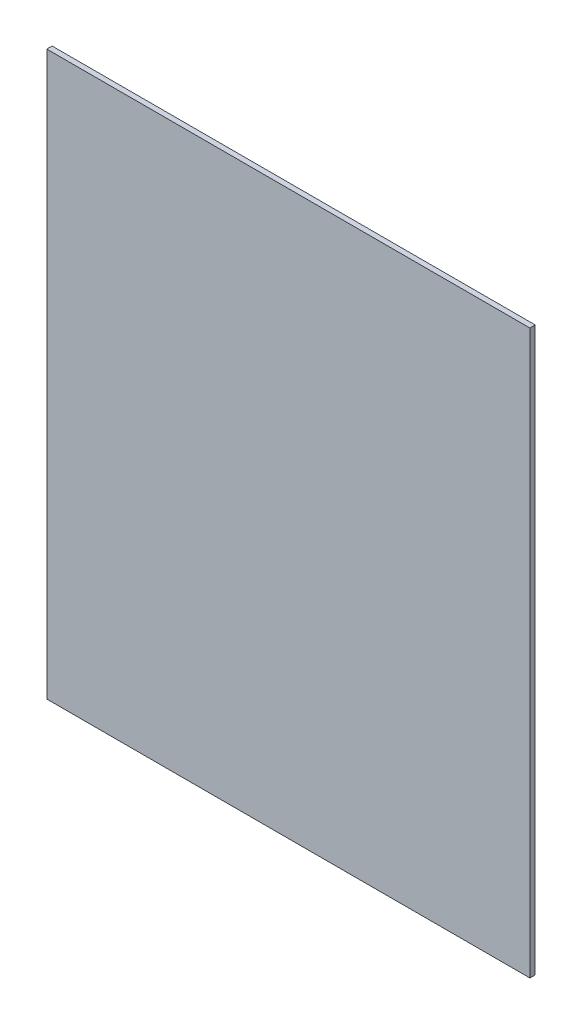
ISO-10303-21;
HEADER;
FILE_DESCRIPTION(('STEP AP214'),'2;1');
FILE_NAME('part.step','',(''),(''),'','','');
FILE_SCHEMA(('AUTOMOTIVE_DESIGN { 1 0 10303 214 1 1 1 1 }'));
ENDSEC;
DATA;
#1=APPLICATION_CONTEXT('core data for automotive mechanical design processes');
#2=APPLICATION_PROTOCOL_DEFINITION('international standard','automotive_design',2000,#1);
#3=PRODUCT_CONTEXT('',#1,'mechanical');
#4=PRODUCT('Part','Part','',(#3));
#5=PRODUCT_RELATED_PRODUCT_CATEGORY('part','',(#4));
#6=PRODUCT_DEFINITION_FORMATION('','',#4);
#7=PRODUCT_DEFINITION_CONTEXT('part definition',#1,'design');
#8=PRODUCT_DEFINITION('design','',#6,#7);
#9=PRODUCT_DEFINITION_SHAPE('','',#8);
#10=(LENGTH_UNIT() NAMED_UNIT(*) SI_UNIT(.MILLI.,.METRE.));
#11=(NAMED_UNIT(*) PLANE_ANGLE_UNIT() SI_UNIT($,.RADIAN.));
#12=(NAMED_UNIT(*) SI_UNIT($,.STERADIAN.) SOLID_ANGLE_UNIT());
#13=UNCERTAINTY_MEASURE_WITH_UNIT(LENGTH_MEASURE(1.E-05),#10,'distance_accuracy_value','');
#14=(GEOMETRIC_REPRESENTATION_CONTEXT(3) GLOBAL_UNCERTAINTY_ASSIGNED_CONTEXT((#13)) GLOBAL_UNIT_ASSIGNED_CONTEXT((#10,
#11,#12)) REPRESENTATION_CONTEXT('',''));
#15=CARTESIAN_POINT('',(0.,0.,0.));
#16=DIRECTION('',(0.,0.,1.));
#17=DIRECTION('',(1.,0.,0.));
#18=AXIS2_PLACEMENT_3D('',#15,#16,#17);
#19=CARTESIAN_POINT('',(-9109.51586601556,9521.14837073355,10.));
#20=DIRECTION('',(-1.,0.,0.));
#21=DIRECTION('',(0.,0.,1.));
#22=AXIS2_PLACEMENT_3D('',#19,#20,#21);
#23=PLANE('',#22);
#24=DIRECTION('',(0.,1.,0.));
#25=VECTOR('',#24,1.);
#26=CARTESIAN_POINT('',(-9109.51586601556,9521.14837073355,0.));
#27=LINE('',#26,#25);
#28=CARTESIAN_POINT('',(-9109.51586601556,8461.14837073355,0.));
#29=VERTEX_POINT('',#28);
#30=CARTESIAN_POINT('',(-9109.51586601556,9521.14837073355,0.));
#31=VERTEX_POINT('',#30);
#32=EDGE_CURVE('E97',#29,#31,#27,.T.);
#33=ORIENTED_EDGE('',*,*,#32,.T.);
#34=DIRECTION('',(0.,0.,-1.));
#35=VECTOR('',#34,1.);
#36=CARTESIAN_POINT('',(-9109.51586601556,9521.14837073355,10.));
#37=LINE('',#36,#35);
#38=CARTESIAN_POINT('',(-9109.51586601556,9521.14837073355,10.));
#39=VERTEX_POINT('',#38);
#40=EDGE_CURVE('E11',#39,#31,#37,.T.);
#41=ORIENTED_EDGE('',*,*,#40,.F.);
#42=DIRECTION('',(0.,1.,0.));
#43=VECTOR('',#42,1.);
#44=CARTESIAN_POINT('',(-9109.51586601556,9521.14837073355,10.));
#45=LINE('',#44,#43);
#46=CARTESIAN_POINT('',(-9109.51586601556,8461.14837073355,10.));
#47=VERTEX_POINT('',#46);
#48=EDGE_CURVE('E85',#47,#39,#45,.T.);
#49=ORIENTED_EDGE('',*,*,#48,.F.);
#50=DIRECTION('',(0.,0.,-1.));
#51=VECTOR('',#50,1.);
#52=CARTESIAN_POINT('',(-9109.51586601556,8461.14837073355,10.));
#53=LINE('',#52,#51);
#54=EDGE_CURVE('E93',#47,#29,#53,.T.);
#55=ORIENTED_EDGE('',*,*,#54,.T.);
#56=EDGE_LOOP('',(#33,#41,#49,#55));
#57=FACE_BOUND('',#56,.T.);
#58=ADVANCED_FACE('F34',(#57),#23,.F.);
#59=CARTESIAN_POINT('',(-9109.51586601556,9521.14837073355,10.));
#60=DIRECTION('',(0.,-1.,0.));
#61=DIRECTION('',(0.,0.,-1.));
#62=AXIS2_PLACEMENT_3D('',#59,#60,#61);
#63=PLANE('',#62);
#64=DIRECTION('',(-1.,0.,0.));
#65=VECTOR('',#64,1.);
#66=CARTESIAN_POINT('',(-9109.51586601556,9521.14837073355,0.));
#67=LINE('',#66,#65);
#68=CARTESIAN_POINT('',(-10019.274974328,9521.14837073355,0.));
#69=VERTEX_POINT('',#68);
#70=EDGE_CURVE('E89',#31,#69,#67,.T.);
#71=ORIENTED_EDGE('',*,*,#70,.T.);
#72=DIRECTION('',(0.,0.,-1.));
#73=VECTOR('',#72,1.);
#74=CARTESIAN_POINT('',(-10019.274974328,9521.14837073355,10.));
#75=LINE('',#74,#73);
#76=CARTESIAN_POINT('',(-10019.274974328,9521.14837073355,10.));
#77=VERTEX_POINT('',#76);
#78=EDGE_CURVE('E42',#77,#69,#75,.T.);
#79=ORIENTED_EDGE('',*,*,#78,.F.);
#80=DIRECTION('',(-1.,0.,0.));
#81=VECTOR('',#80,1.);
#82=CARTESIAN_POINT('',(-9109.51586601556,9521.14837073355,10.));
#83=LINE('',#82,#81);
#84=EDGE_CURVE('E80',#39,#77,#83,.T.);
#85=ORIENTED_EDGE('',*,*,#84,.F.);
#86=ORIENTED_EDGE('',*,*,#40,.T.);
#87=EDGE_LOOP('',(#71,#79,#85,#86));
#88=FACE_BOUND('',#87,.T.);
#89=ADVANCED_FACE('F88',(#88),#63,.F.);
#90=CARTESIAN_POINT('',(-10019.274974328,9521.14837073355,10.));
#91=DIRECTION('',(1.,0.,0.));
#92=DIRECTION('',(0.,0.,-1.));
#93=AXIS2_PLACEMENT_3D('',#90,#91,#92);
#94=PLANE('',#93);
#95=DIRECTION('',(0.,-1.,0.));
#96=VECTOR('',#95,1.);
#97=CARTESIAN_POINT('',(-10019.274974328,9521.14837073355,0.));
#98=LINE('',#97,#96);
#99=CARTESIAN_POINT('',(-10019.274974328,8461.14837073355,0.));
#100=VERTEX_POINT('',#99);
#101=EDGE_CURVE('E67',#69,#100,#98,.T.);
#102=ORIENTED_EDGE('',*,*,#101,.T.);
#103=DIRECTION('',(0.,0.,-1.));
#104=VECTOR('',#103,1.);
#105=CARTESIAN_POINT('',(-10019.274974328,8461.14837073355,10.));
#106=LINE('',#105,#104);
#107=CARTESIAN_POINT('',(-10019.274974328,8461.14837073355,10.));
#108=VERTEX_POINT('',#107);
#109=EDGE_CURVE('E90',#108,#100,#106,.T.);
#110=ORIENTED_EDGE('',*,*,#109,.F.);
#111=DIRECTION('',(0.,-1.,0.));
#112=VECTOR('',#111,1.);
#113=CARTESIAN_POINT('',(-10019.274974328,9521.14837073355,10.));
#114=LINE('',#113,#112);
#115=EDGE_CURVE('E83',#77,#108,#114,.T.);
#116=ORIENTED_EDGE('',*,*,#115,.F.);
#117=ORIENTED_EDGE('',*,*,#78,.T.);
#118=EDGE_LOOP('',(#102,#110,#116,#117));
#119=FACE_BOUND('',#118,.T.);
#120=ADVANCED_FACE('F91',(#119),#94,.F.);
#121=CARTESIAN_POINT('',(-9109.51586601556,8461.14837073355,10.));
#122=DIRECTION('',(0.,1.,0.));
#123=DIRECTION('',(0.,0.,1.));
#124=AXIS2_PLACEMENT_3D('',#121,#122,#123);
#125=PLANE('',#124);
#126=DIRECTION('',(1.,0.,0.));
#127=VECTOR('',#126,1.);
#128=CARTESIAN_POINT('',(-9109.51586601556,8461.14837073355,0.));
#129=LINE('',#128,#127);
#130=EDGE_CURVE('E73',#100,#29,#129,.T.);
#131=ORIENTED_EDGE('',*,*,#130,.T.);
#132=ORIENTED_EDGE('',*,*,#54,.F.);
#133=DIRECTION('',(1.,0.,0.));
#134=VECTOR('',#133,1.);
#135=CARTESIAN_POINT('',(-9109.51586601556,8461.14837073355,10.));
#136=LINE('',#135,#134);
#137=EDGE_CURVE('E50',#108,#47,#136,.T.);
#138=ORIENTED_EDGE('',*,*,#137,.F.);
#139=ORIENTED_EDGE('',*,*,#109,.T.);
#140=EDGE_LOOP('',(#131,#132,#138,#139));
#141=FACE_BOUND('',#140,.T.);
#142=ADVANCED_FACE('F104',(#141),#125,.F.);
#143=CARTESIAN_POINT('',(0.,0.,10.));
#144=DIRECTION('',(0.,0.,-1.));
#145=DIRECTION('',(-1.,0.,0.));
#146=AXIS2_PLACEMENT_3D('',#143,#144,#145);
#147=PLANE('',#146);
#148=ORIENTED_EDGE('',*,*,#48,.T.);
#149=ORIENTED_EDGE('',*,*,#84,.T.);
#150=ORIENTED_EDGE('',*,*,#115,.T.);
#151=ORIENTED_EDGE('',*,*,#137,.T.);
#152=EDGE_LOOP('',(#148,#149,#150,#151));
#153=FACE_BOUND('',#152,.T.);
#154=ADVANCED_FACE('F81',(#153),#147,.F.);
#155=CARTESIAN_POINT('',(0.,0.,0.));
#156=DIRECTION('',(0.,0.,-1.));
#157=DIRECTION('',(-1.,0.,0.));
#158=AXIS2_PLACEMENT_3D('',#155,#156,#157);
#159=PLANE('',#158);
#160=ORIENTED_EDGE('',*,*,#32,.F.);
#161=ORIENTED_EDGE('',*,*,#130,.F.);
#162=ORIENTED_EDGE('',*,*,#101,.F.);
#163=ORIENTED_EDGE('',*,*,#70,.F.);
#164=EDGE_LOOP('',(#160,#161,#162,#163));
#165=FACE_BOUND('',#164,.T.);
#166=ADVANCED_FACE('F107',(#165),#159,.T.);
#167=CLOSED_SHELL('',(#58,#89,#120,#142,#154,#166));
#168=MANIFOLD_SOLID_BREP('B2',#167);
#169=ADVANCED_BREP_SHAPE_REPRESENTATION('',(#18,#168),#14);
#170=SHAPE_DEFINITION_REPRESENTATION(#9,#169);
ENDSEC;
END-ISO-10303-21;
